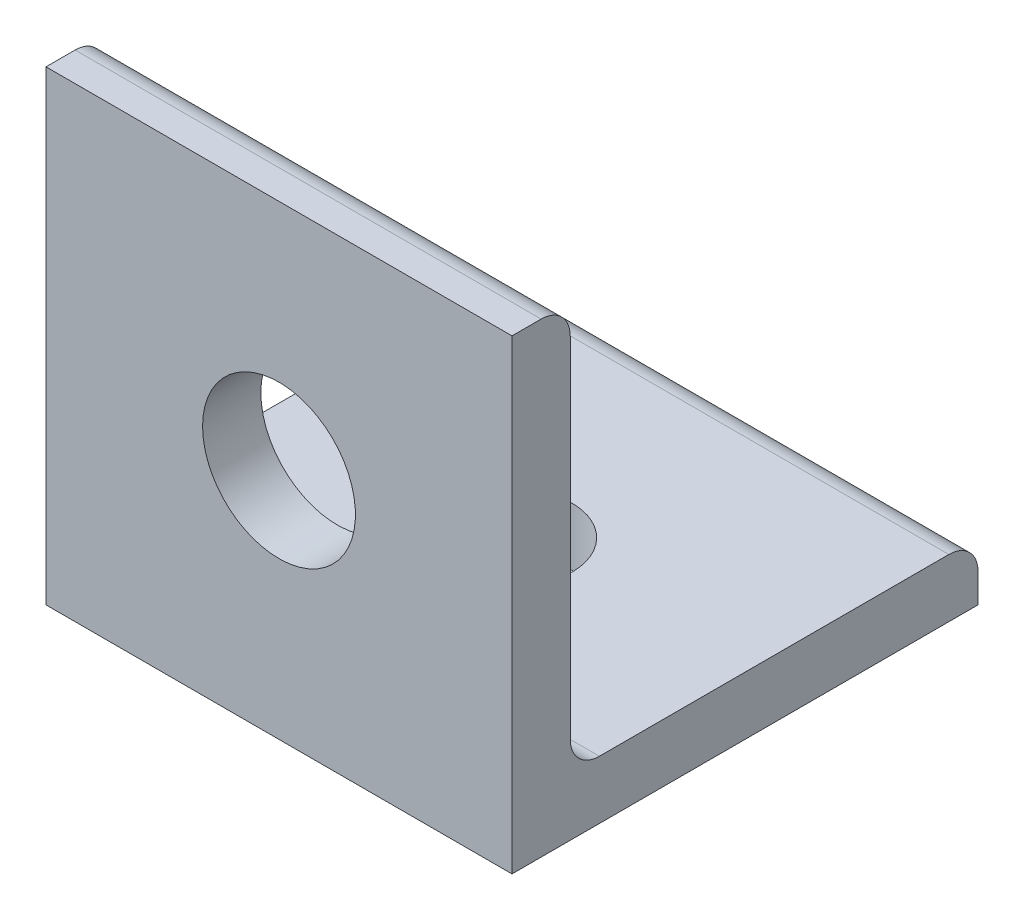
ISO-10303-21;
HEADER;
FILE_DESCRIPTION(('STEP AP214'),'2;1');
FILE_NAME('part.step','',(''),(''),'','','');
FILE_SCHEMA(('AUTOMOTIVE_DESIGN { 1 0 10303 214 1 1 1 1 }'));
ENDSEC;
DATA;
#1=APPLICATION_CONTEXT('core data for automotive mechanical design processes');
#2=APPLICATION_PROTOCOL_DEFINITION('international standard','automotive_design',2000,#1);
#3=PRODUCT_CONTEXT('',#1,'mechanical');
#4=PRODUCT('Part','Part','',(#3));
#5=PRODUCT_RELATED_PRODUCT_CATEGORY('part','',(#4));
#6=PRODUCT_DEFINITION_FORMATION('','',#4);
#7=PRODUCT_DEFINITION_CONTEXT('part definition',#1,'design');
#8=PRODUCT_DEFINITION('design','',#6,#7);
#9=PRODUCT_DEFINITION_SHAPE('','',#8);
#10=(LENGTH_UNIT() NAMED_UNIT(*) SI_UNIT(.MILLI.,.METRE.));
#11=(NAMED_UNIT(*) PLANE_ANGLE_UNIT() SI_UNIT($,.RADIAN.));
#12=(NAMED_UNIT(*) SI_UNIT($,.STERADIAN.) SOLID_ANGLE_UNIT());
#13=UNCERTAINTY_MEASURE_WITH_UNIT(LENGTH_MEASURE(1.E-05),#10,'distance_accuracy_value','');
#14=(GEOMETRIC_REPRESENTATION_CONTEXT(3) GLOBAL_UNCERTAINTY_ASSIGNED_CONTEXT((#13)) GLOBAL_UNIT_ASSIGNED_CONTEXT((#10,
#11,#12)) REPRESENTATION_CONTEXT('',''));
#15=CARTESIAN_POINT('',(0.,0.,0.));
#16=DIRECTION('',(0.,0.,1.));
#17=DIRECTION('',(1.,0.,0.));
#18=AXIS2_PLACEMENT_3D('',#15,#16,#17);
#19=CARTESIAN_POINT('',(12.7,0.,0.));
#20=DIRECTION('',(0.,1.,0.));
#21=DIRECTION('',(0.,0.,1.));
#22=AXIS2_PLACEMENT_3D('',#19,#20,#21);
#23=PLANE('',#22);
#24=CARTESIAN_POINT('',(0.,0.,-12.7));
#25=DIRECTION('',(0.,1.,0.));
#26=DIRECTION('',(0.,0.,1.));
#27=AXIS2_PLACEMENT_3D('',#24,#25,#26);
#28=CIRCLE('',#27,3.2639);
#29=CARTESIAN_POINT('',(0.,0.,-9.4361));
#30=VERTEX_POINT('',#29);
#31=EDGE_CURVE('E240',#30,#30,#28,.T.);
#32=ORIENTED_EDGE('',*,*,#31,.T.);
#33=EDGE_LOOP('',(#32));
#34=FACE_BOUND('',#33,.T.);
#35=DIRECTION('',(0.,0.,-1.));
#36=VECTOR('',#35,1.);
#37=CARTESIAN_POINT('',(-12.7,0.,0.));
#38=LINE('',#37,#36);
#39=CARTESIAN_POINT('',(-12.7,0.,0.));
#40=VERTEX_POINT('',#39);
#41=CARTESIAN_POINT('',(-12.7,0.,-25.4));
#42=VERTEX_POINT('',#41);
#43=EDGE_CURVE('E126',#40,#42,#38,.T.);
#44=ORIENTED_EDGE('',*,*,#43,.T.);
#45=DIRECTION('',(-1.,0.,0.));
#46=VECTOR('',#45,1.);
#47=CARTESIAN_POINT('',(12.7,0.,-25.4));
#48=LINE('',#47,#46);
#49=CARTESIAN_POINT('',(12.7,0.,-25.4));
#50=VERTEX_POINT('',#49);
#51=EDGE_CURVE('E108',#50,#42,#48,.T.);
#52=ORIENTED_EDGE('',*,*,#51,.F.);
#53=DIRECTION('',(0.,0.,-1.));
#54=VECTOR('',#53,1.);
#55=CARTESIAN_POINT('',(12.7,0.,0.));
#56=LINE('',#55,#54);
#57=CARTESIAN_POINT('',(12.7,0.,0.));
#58=VERTEX_POINT('',#57);
#59=EDGE_CURVE('E114',#58,#50,#56,.T.);
#60=ORIENTED_EDGE('',*,*,#59,.F.);
#61=DIRECTION('',(-1.,0.,0.));
#62=VECTOR('',#61,1.);
#63=CARTESIAN_POINT('',(12.7,0.,0.));
#64=LINE('',#63,#62);
#65=EDGE_CURVE('E132',#58,#40,#64,.T.);
#66=ORIENTED_EDGE('',*,*,#65,.T.);
#67=EDGE_LOOP('',(#44,#52,#60,#66));
#68=FACE_BOUND('',#67,.T.);
#69=ADVANCED_FACE('F32',(#34,#68),#23,.F.);
#70=CARTESIAN_POINT('',(12.7,3.175,-25.4));
#71=DIRECTION('',(0.,0.,-1.));
#72=DIRECTION('',(-1.,0.,0.));
#73=AXIS2_PLACEMENT_3D('',#70,#71,#72);
#74=PLANE('',#73);
#75=DIRECTION('',(0.,-1.,0.));
#76=VECTOR('',#75,1.);
#77=CARTESIAN_POINT('',(-12.7,3.175,-25.4));
#78=LINE('',#77,#76);
#79=CARTESIAN_POINT('',(-12.7,1.5875,-25.4));
#80=VERTEX_POINT('',#79);
#81=EDGE_CURVE('E168',#80,#42,#78,.T.);
#82=ORIENTED_EDGE('',*,*,#81,.F.);
#83=DIRECTION('',(-1.,0.,0.));
#84=VECTOR('',#83,1.);
#85=CARTESIAN_POINT('',(12.7,1.5875,-25.4));
#86=LINE('',#85,#84);
#87=CARTESIAN_POINT('',(12.7,1.5875,-25.4));
#88=VERTEX_POINT('',#87);
#89=EDGE_CURVE('E111',#80,#88,#86,.F.);
#90=ORIENTED_EDGE('',*,*,#89,.T.);
#91=DIRECTION('',(0.,-1.,0.));
#92=VECTOR('',#91,1.);
#93=CARTESIAN_POINT('',(12.7,3.175,-25.4));
#94=LINE('',#93,#92);
#95=EDGE_CURVE('E103',#88,#50,#94,.T.);
#96=ORIENTED_EDGE('',*,*,#95,.T.);
#97=ORIENTED_EDGE('',*,*,#51,.T.);
#98=EDGE_LOOP('',(#82,#90,#96,#97));
#99=FACE_BOUND('',#98,.T.);
#100=ADVANCED_FACE('F106',(#99),#74,.T.);
#101=CARTESIAN_POINT('',(12.7,3.175,0.));
#102=DIRECTION('',(0.,1.,0.));
#103=DIRECTION('',(0.,0.,1.));
#104=AXIS2_PLACEMENT_3D('',#101,#102,#103);
#105=PLANE('',#104);
#106=CARTESIAN_POINT('',(0.,3.175,-12.7));
#107=DIRECTION('',(0.,1.,0.));
#108=DIRECTION('',(0.,0.,1.));
#109=AXIS2_PLACEMENT_3D('',#106,#107,#108);
#110=CIRCLE('',#109,3.2639);
#111=CARTESIAN_POINT('',(0.,3.175,-9.4361));
#112=VERTEX_POINT('',#111);
#113=EDGE_CURVE('E243',#112,#112,#110,.T.);
#114=ORIENTED_EDGE('',*,*,#113,.F.);
#115=EDGE_LOOP('',(#114));
#116=FACE_BOUND('',#115,.T.);
#117=DIRECTION('',(0.,0.,-1.));
#118=VECTOR('',#117,1.);
#119=CARTESIAN_POINT('',(12.7,3.175,0.));
#120=LINE('',#119,#118);
#121=CARTESIAN_POINT('',(12.7,3.175,-4.7625));
#122=VERTEX_POINT('',#121);
#123=CARTESIAN_POINT('',(12.7,3.175,-23.8125));
#124=VERTEX_POINT('',#123);
#125=EDGE_CURVE('E113',#122,#124,#120,.T.);
#126=ORIENTED_EDGE('',*,*,#125,.T.);
#127=DIRECTION('',(-1.,0.,0.));
#128=VECTOR('',#127,1.);
#129=CARTESIAN_POINT('',(12.7,3.175,-23.8125));
#130=LINE('',#129,#128);
#131=CARTESIAN_POINT('',(-12.7,3.175,-23.8125));
#132=VERTEX_POINT('',#131);
#133=EDGE_CURVE('E130',#124,#132,#130,.T.);
#134=ORIENTED_EDGE('',*,*,#133,.T.);
#135=DIRECTION('',(0.,0.,-1.));
#136=VECTOR('',#135,1.);
#137=CARTESIAN_POINT('',(-12.7,3.175,0.));
#138=LINE('',#137,#136);
#139=CARTESIAN_POINT('',(-12.7,3.175,-4.7625));
#140=VERTEX_POINT('',#139);
#141=EDGE_CURVE('E158',#140,#132,#138,.T.);
#142=ORIENTED_EDGE('',*,*,#141,.F.);
#143=DIRECTION('',(-1.,0.,0.));
#144=VECTOR('',#143,1.);
#145=CARTESIAN_POINT('',(12.7,3.175,-4.7625));
#146=LINE('',#145,#144);
#147=EDGE_CURVE('E127',#140,#122,#146,.F.);
#148=ORIENTED_EDGE('',*,*,#147,.T.);
#149=EDGE_LOOP('',(#126,#134,#142,#148));
#150=FACE_BOUND('',#149,.T.);
#151=ADVANCED_FACE('F166',(#116,#150),#105,.T.);
#152=CARTESIAN_POINT('',(12.7,0.,-3.175));
#153=DIRECTION('',(0.,0.,-1.));
#154=DIRECTION('',(-1.,0.,0.));
#155=AXIS2_PLACEMENT_3D('',#152,#153,#154);
#156=PLANE('',#155);
#157=CARTESIAN_POINT('',(0.,12.7,-3.175));
#158=DIRECTION('',(0.,0.,-1.));
#159=DIRECTION('',(-1.,0.,0.));
#160=AXIS2_PLACEMENT_3D('',#157,#158,#159);
#161=CIRCLE('',#160,4.1656);
#162=CARTESIAN_POINT('',(-4.1656,12.7,-3.175));
#163=VERTEX_POINT('',#162);
#164=EDGE_CURVE('E239',#163,#163,#161,.T.);
#165=ORIENTED_EDGE('',*,*,#164,.F.);
#166=EDGE_LOOP('',(#165));
#167=FACE_BOUND('',#166,.T.);
#168=DIRECTION('',(0.,1.,0.));
#169=VECTOR('',#168,1.);
#170=CARTESIAN_POINT('',(12.7,0.,-3.175));
#171=LINE('',#170,#169);
#172=CARTESIAN_POINT('',(12.7,23.8125,-3.175));
#173=VERTEX_POINT('',#172);
#174=CARTESIAN_POINT('',(12.7,4.7625,-3.175));
#175=VERTEX_POINT('',#174);
#176=EDGE_CURVE('E174',#173,#175,#171,.F.);
#177=ORIENTED_EDGE('',*,*,#176,.T.);
#178=DIRECTION('',(-1.,0.,0.));
#179=VECTOR('',#178,1.);
#180=CARTESIAN_POINT('',(-12.7,4.7625,-3.175));
#181=LINE('',#180,#179);
#182=CARTESIAN_POINT('',(-12.7,4.7625,-3.175));
#183=VERTEX_POINT('',#182);
#184=EDGE_CURVE('E148',#175,#183,#181,.T.);
#185=ORIENTED_EDGE('',*,*,#184,.T.);
#186=DIRECTION('',(0.,1.,0.));
#187=VECTOR('',#186,1.);
#188=CARTESIAN_POINT('',(-12.7,0.,-3.175));
#189=LINE('',#188,#187);
#190=CARTESIAN_POINT('',(-12.7,23.8125,-3.175));
#191=VERTEX_POINT('',#190);
#192=EDGE_CURVE('E160',#191,#183,#189,.F.);
#193=ORIENTED_EDGE('',*,*,#192,.F.);
#194=DIRECTION('',(-1.,0.,0.));
#195=VECTOR('',#194,1.);
#196=CARTESIAN_POINT('',(12.7,23.8125,-3.175));
#197=LINE('',#196,#195);
#198=EDGE_CURVE('E146',#191,#173,#197,.F.);
#199=ORIENTED_EDGE('',*,*,#198,.T.);
#200=EDGE_LOOP('',(#177,#185,#193,#199));
#201=FACE_BOUND('',#200,.T.);
#202=ADVANCED_FACE('F172',(#167,#201),#156,.T.);
#203=CARTESIAN_POINT('',(12.7,25.4,0.));
#204=DIRECTION('',(0.,1.,0.));
#205=DIRECTION('',(0.,0.,1.));
#206=AXIS2_PLACEMENT_3D('',#203,#204,#205);
#207=PLANE('',#206);
#208=DIRECTION('',(0.,0.,-1.));
#209=VECTOR('',#208,1.);
#210=CARTESIAN_POINT('',(12.7,25.4,0.));
#211=LINE('',#210,#209);
#212=CARTESIAN_POINT('',(12.7,25.4,0.));
#213=VERTEX_POINT('',#212);
#214=CARTESIAN_POINT('',(12.7,25.4,-1.5875));
#215=VERTEX_POINT('',#214);
#216=EDGE_CURVE('E175',#213,#215,#211,.T.);
#217=ORIENTED_EDGE('',*,*,#216,.T.);
#218=DIRECTION('',(-1.,0.,0.));
#219=VECTOR('',#218,1.);
#220=CARTESIAN_POINT('',(12.7,25.4,-1.5875));
#221=LINE('',#220,#219);
#222=CARTESIAN_POINT('',(-12.7,25.4,-1.5875));
#223=VERTEX_POINT('',#222);
#224=EDGE_CURVE('E151',#215,#223,#221,.T.);
#225=ORIENTED_EDGE('',*,*,#224,.T.);
#226=DIRECTION('',(0.,0.,-1.));
#227=VECTOR('',#226,1.);
#228=CARTESIAN_POINT('',(-12.7,25.4,0.));
#229=LINE('',#228,#227);
#230=CARTESIAN_POINT('',(-12.7,25.4,0.));
#231=VERTEX_POINT('',#230);
#232=EDGE_CURVE('E185',#231,#223,#229,.T.);
#233=ORIENTED_EDGE('',*,*,#232,.F.);
#234=DIRECTION('',(-1.,0.,0.));
#235=VECTOR('',#234,1.);
#236=CARTESIAN_POINT('',(12.7,25.4,0.));
#237=LINE('',#236,#235);
#238=EDGE_CURVE('E128',#213,#231,#237,.T.);
#239=ORIENTED_EDGE('',*,*,#238,.F.);
#240=EDGE_LOOP('',(#217,#225,#233,#239));
#241=FACE_BOUND('',#240,.T.);
#242=ADVANCED_FACE('F217',(#241),#207,.T.);
#243=CARTESIAN_POINT('',(12.7,0.,0.));
#244=DIRECTION('',(0.,0.,-1.));
#245=DIRECTION('',(-1.,0.,0.));
#246=AXIS2_PLACEMENT_3D('',#243,#244,#245);
#247=PLANE('',#246);
#248=CARTESIAN_POINT('',(0.,12.7,0.));
#249=DIRECTION('',(0.,0.,-1.));
#250=DIRECTION('',(-1.,0.,0.));
#251=AXIS2_PLACEMENT_3D('',#248,#249,#250);
#252=CIRCLE('',#251,4.1656);
#253=CARTESIAN_POINT('',(-4.1656,12.7,0.));
#254=VERTEX_POINT('',#253);
#255=EDGE_CURVE('E182',#254,#254,#252,.T.);
#256=ORIENTED_EDGE('',*,*,#255,.T.);
#257=EDGE_LOOP('',(#256));
#258=FACE_BOUND('',#257,.T.);
#259=DIRECTION('',(0.,-1.,0.));
#260=VECTOR('',#259,1.);
#261=CARTESIAN_POINT('',(-12.7,0.,0.));
#262=LINE('',#261,#260);
#263=EDGE_CURVE('E123',#231,#40,#262,.T.);
#264=ORIENTED_EDGE('',*,*,#263,.T.);
#265=ORIENTED_EDGE('',*,*,#65,.F.);
#266=DIRECTION('',(0.,-1.,0.));
#267=VECTOR('',#266,1.);
#268=CARTESIAN_POINT('',(12.7,0.,0.));
#269=LINE('',#268,#267);
#270=EDGE_CURVE('E119',#213,#58,#269,.T.);
#271=ORIENTED_EDGE('',*,*,#270,.F.);
#272=ORIENTED_EDGE('',*,*,#238,.T.);
#273=EDGE_LOOP('',(#264,#265,#271,#272));
#274=FACE_BOUND('',#273,.T.);
#275=ADVANCED_FACE('F221',(#258,#274),#247,.F.);
#276=CARTESIAN_POINT('',(12.7,0.,-25.4));
#277=DIRECTION('',(-1.,0.,0.));
#278=DIRECTION('',(0.,0.,1.));
#279=AXIS2_PLACEMENT_3D('',#276,#277,#278);
#280=PLANE('',#279);
#281=ORIENTED_EDGE('',*,*,#95,.F.);
#282=CARTESIAN_POINT('',(12.7,1.5875,-23.8125));
#283=DIRECTION('',(-1.,0.,0.));
#284=DIRECTION('',(0.,0.,1.));
#285=AXIS2_PLACEMENT_3D('',#282,#283,#284);
#286=CIRCLE('',#285,1.5875);
#287=EDGE_CURVE('E144',#88,#124,#286,.F.);
#288=ORIENTED_EDGE('',*,*,#287,.T.);
#289=ORIENTED_EDGE('',*,*,#125,.F.);
#290=CARTESIAN_POINT('',(12.7,4.7625,-4.7625));
#291=DIRECTION('',(-1.,0.,0.));
#292=DIRECTION('',(0.,0.,1.));
#293=AXIS2_PLACEMENT_3D('',#290,#291,#292);
#294=CIRCLE('',#293,1.5875);
#295=EDGE_CURVE('E11',#122,#175,#294,.T.);
#296=ORIENTED_EDGE('',*,*,#295,.T.);
#297=ORIENTED_EDGE('',*,*,#176,.F.);
#298=CARTESIAN_POINT('',(12.7,23.8125,-1.5875));
#299=DIRECTION('',(-1.,0.,0.));
#300=DIRECTION('',(0.,0.,1.));
#301=AXIS2_PLACEMENT_3D('',#298,#299,#300);
#302=CIRCLE('',#301,1.5875);
#303=EDGE_CURVE('E47',#173,#215,#302,.F.);
#304=ORIENTED_EDGE('',*,*,#303,.T.);
#305=ORIENTED_EDGE('',*,*,#216,.F.);
#306=ORIENTED_EDGE('',*,*,#270,.T.);
#307=ORIENTED_EDGE('',*,*,#59,.T.);
#308=EDGE_LOOP('',(#281,#288,#289,#296,#297,#304,#305,#306,#307));
#309=FACE_BOUND('',#308,.T.);
#310=ADVANCED_FACE('F117',(#309),#280,.F.);
#311=CARTESIAN_POINT('',(-12.7,0.,-25.4));
#312=DIRECTION('',(-1.,0.,0.));
#313=DIRECTION('',(0.,0.,1.));
#314=AXIS2_PLACEMENT_3D('',#311,#312,#313);
#315=PLANE('',#314);
#316=ORIENTED_EDGE('',*,*,#141,.T.);
#317=CARTESIAN_POINT('',(-12.7,1.5875,-23.8125));
#318=DIRECTION('',(-1.,0.,0.));
#319=DIRECTION('',(0.,0.,1.));
#320=AXIS2_PLACEMENT_3D('',#317,#318,#319);
#321=CIRCLE('',#320,1.5875);
#322=EDGE_CURVE('E140',#132,#80,#321,.T.);
#323=ORIENTED_EDGE('',*,*,#322,.T.);
#324=ORIENTED_EDGE('',*,*,#81,.T.);
#325=ORIENTED_EDGE('',*,*,#43,.F.);
#326=ORIENTED_EDGE('',*,*,#263,.F.);
#327=ORIENTED_EDGE('',*,*,#232,.T.);
#328=CARTESIAN_POINT('',(-12.7,23.8125,-1.5875));
#329=DIRECTION('',(-1.,0.,0.));
#330=DIRECTION('',(0.,0.,1.));
#331=AXIS2_PLACEMENT_3D('',#328,#329,#330);
#332=CIRCLE('',#331,1.5875);
#333=EDGE_CURVE('E138',#223,#191,#332,.T.);
#334=ORIENTED_EDGE('',*,*,#333,.T.);
#335=ORIENTED_EDGE('',*,*,#192,.T.);
#336=CARTESIAN_POINT('',(-12.7,4.7625,-4.7625));
#337=DIRECTION('',(-1.,0.,0.));
#338=DIRECTION('',(0.,0.,1.));
#339=AXIS2_PLACEMENT_3D('',#336,#337,#338);
#340=CIRCLE('',#339,1.5875);
#341=EDGE_CURVE('E40',#183,#140,#340,.F.);
#342=ORIENTED_EDGE('',*,*,#341,.T.);
#343=EDGE_LOOP('',(#316,#323,#324,#325,#326,#327,#334,#335,#342));
#344=FACE_BOUND('',#343,.T.);
#345=ADVANCED_FACE('F157',(#344),#315,.T.);
#346=CARTESIAN_POINT('',(0.,12.7,0.));
#347=DIRECTION('',(0.,0.,-1.));
#348=DIRECTION('',(-1.,0.,0.));
#349=AXIS2_PLACEMENT_3D('',#346,#347,#348);
#350=CYLINDRICAL_SURFACE('',#349,4.1656);
#351=ORIENTED_EDGE('',*,*,#255,.F.);
#352=EDGE_LOOP('',(#351));
#353=FACE_BOUND('',#352,.T.);
#354=ORIENTED_EDGE('',*,*,#164,.T.);
#355=EDGE_LOOP('',(#354));
#356=FACE_BOUND('',#355,.T.);
#357=ADVANCED_FACE('F200',(#353,#356),#350,.F.);
#358=CARTESIAN_POINT('',(0.,0.,-12.7));
#359=DIRECTION('',(0.,1.,0.));
#360=DIRECTION('',(0.,0.,1.));
#361=AXIS2_PLACEMENT_3D('',#358,#359,#360);
#362=CYLINDRICAL_SURFACE('',#361,3.2639);
#363=ORIENTED_EDGE('',*,*,#31,.F.);
#364=EDGE_LOOP('',(#363));
#365=FACE_BOUND('',#364,.T.);
#366=ORIENTED_EDGE('',*,*,#113,.T.);
#367=EDGE_LOOP('',(#366));
#368=FACE_BOUND('',#367,.T.);
#369=ADVANCED_FACE('F194',(#365,#368),#362,.F.);
#370=CARTESIAN_POINT('',(12.7,1.5875,-23.8125));
#371=DIRECTION('',(-1.,0.,0.));
#372=DIRECTION('',(0.,0.,1.));
#373=AXIS2_PLACEMENT_3D('',#370,#371,#372);
#374=CYLINDRICAL_SURFACE('',#373,1.5875);
#375=ORIENTED_EDGE('',*,*,#287,.F.);
#376=ORIENTED_EDGE('',*,*,#89,.F.);
#377=ORIENTED_EDGE('',*,*,#322,.F.);
#378=ORIENTED_EDGE('',*,*,#133,.F.);
#379=EDGE_LOOP('',(#375,#376,#377,#378));
#380=FACE_BOUND('',#379,.T.);
#381=ADVANCED_FACE('F192',(#380),#374,.T.);
#382=CARTESIAN_POINT('',(12.7,4.7625,-4.7625));
#383=DIRECTION('',(1.,0.,0.));
#384=DIRECTION('',(0.,0.,-1.));
#385=AXIS2_PLACEMENT_3D('',#382,#383,#384);
#386=CYLINDRICAL_SURFACE('',#385,1.5875);
#387=ORIENTED_EDGE('',*,*,#295,.F.);
#388=ORIENTED_EDGE('',*,*,#147,.F.);
#389=ORIENTED_EDGE('',*,*,#341,.F.);
#390=ORIENTED_EDGE('',*,*,#184,.F.);
#391=EDGE_LOOP('',(#387,#388,#389,#390));
#392=FACE_BOUND('',#391,.T.);
#393=ADVANCED_FACE('F170',(#392),#386,.F.);
#394=CARTESIAN_POINT('',(12.7,23.8125,-1.5875));
#395=DIRECTION('',(-1.,0.,0.));
#396=DIRECTION('',(0.,0.,1.));
#397=AXIS2_PLACEMENT_3D('',#394,#395,#396);
#398=CYLINDRICAL_SURFACE('',#397,1.5875);
#399=ORIENTED_EDGE('',*,*,#303,.F.);
#400=ORIENTED_EDGE('',*,*,#198,.F.);
#401=ORIENTED_EDGE('',*,*,#333,.F.);
#402=ORIENTED_EDGE('',*,*,#224,.F.);
#403=EDGE_LOOP('',(#399,#400,#401,#402));
#404=FACE_BOUND('',#403,.T.);
#405=ADVANCED_FACE('F34',(#404),#398,.T.);
#406=CLOSED_SHELL('',(#69,#100,#151,#202,#242,#275,#310,#345,#357,#369,#381,#393,#405));
#407=MANIFOLD_SOLID_BREP('B2',#406);
#408=ADVANCED_BREP_SHAPE_REPRESENTATION('',(#18,#407),#14);
#409=SHAPE_DEFINITION_REPRESENTATION(#9,#408);
ENDSEC;
END-ISO-10303-21;
